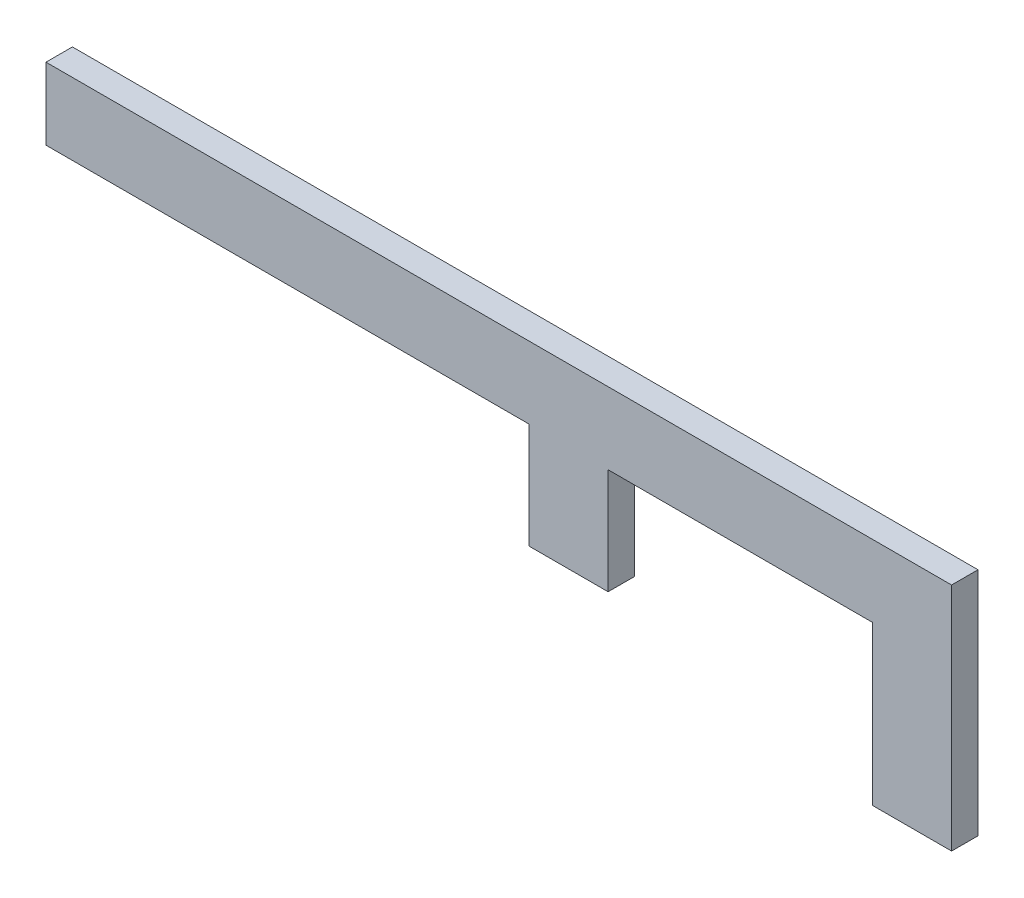
ISO-10303-21;
HEADER;
FILE_DESCRIPTION(('STEP AP214'),'2;1');
FILE_NAME('part.step','',(''),(''),'','','');
FILE_SCHEMA(('AUTOMOTIVE_DESIGN { 1 0 10303 214 1 1 1 1 }'));
ENDSEC;
DATA;
#1=APPLICATION_CONTEXT('core data for automotive mechanical design processes');
#2=APPLICATION_PROTOCOL_DEFINITION('international standard','automotive_design',2000,#1);
#3=PRODUCT_CONTEXT('',#1,'mechanical');
#4=PRODUCT('Part','Part','',(#3));
#5=PRODUCT_RELATED_PRODUCT_CATEGORY('part','',(#4));
#6=PRODUCT_DEFINITION_FORMATION('','',#4);
#7=PRODUCT_DEFINITION_CONTEXT('part definition',#1,'design');
#8=PRODUCT_DEFINITION('design','',#6,#7);
#9=PRODUCT_DEFINITION_SHAPE('','',#8);
#10=(LENGTH_UNIT() NAMED_UNIT(*) SI_UNIT(.MILLI.,.METRE.));
#11=(NAMED_UNIT(*) PLANE_ANGLE_UNIT() SI_UNIT($,.RADIAN.));
#12=(NAMED_UNIT(*) SI_UNIT($,.STERADIAN.) SOLID_ANGLE_UNIT());
#13=UNCERTAINTY_MEASURE_WITH_UNIT(LENGTH_MEASURE(1.E-05),#10,'distance_accuracy_value','');
#14=(GEOMETRIC_REPRESENTATION_CONTEXT(3) GLOBAL_UNCERTAINTY_ASSIGNED_CONTEXT((#13)) GLOBAL_UNIT_ASSIGNED_CONTEXT((#10,
#11,#12)) REPRESENTATION_CONTEXT('',''));
#15=CARTESIAN_POINT('',(0.,0.,0.));
#16=DIRECTION('',(0.,0.,1.));
#17=DIRECTION('',(1.,0.,0.));
#18=AXIS2_PLACEMENT_3D('',#15,#16,#17);
#19=CARTESIAN_POINT('',(18.4937207754592,-27.2192634151137,10.));
#20=DIRECTION('',(0.,1.,0.));
#21=DIRECTION('',(0.,0.,1.));
#22=AXIS2_PLACEMENT_3D('',#19,#20,#21);
#23=PLANE('',#22);
#24=DIRECTION('',(0.,0.,1.));
#25=VECTOR('',#24,1.);
#26=CARTESIAN_POINT('',(127.754406597199,-27.2192634151137,10.));
#27=LINE('',#26,#25);
#28=CARTESIAN_POINT('',(127.754406597199,-27.2192634151137,0.));
#29=VERTEX_POINT('',#28);
#30=CARTESIAN_POINT('',(127.754406597199,-27.2192634151135,10.));
#31=VERTEX_POINT('',#30);
#32=EDGE_CURVE('E135',#29,#31,#27,.T.);
#33=ORIENTED_EDGE('',*,*,#32,.F.);
#34=DIRECTION('',(1.,0.,0.));
#35=VECTOR('',#34,1.);
#36=CARTESIAN_POINT('',(18.4937207754592,-27.2192634151137,0.));
#37=LINE('',#36,#35);
#38=CARTESIAN_POINT('',(227.754406597199,-27.2192634151137,0.));
#39=VERTEX_POINT('',#38);
#40=EDGE_CURVE('E172',#29,#39,#37,.T.);
#41=ORIENTED_EDGE('',*,*,#40,.T.);
#42=DIRECTION('',(0.,0.,-1.));
#43=VECTOR('',#42,1.);
#44=CARTESIAN_POINT('',(227.754406597199,-27.2192634151137,10.));
#45=LINE('',#44,#43);
#46=CARTESIAN_POINT('',(227.754406597199,-27.2192634151135,10.));
#47=VERTEX_POINT('',#46);
#48=EDGE_CURVE('E136',#47,#39,#45,.T.);
#49=ORIENTED_EDGE('',*,*,#48,.F.);
#50=DIRECTION('',(1.,0.,0.));
#51=VECTOR('',#50,1.);
#52=CARTESIAN_POINT('',(-80.,-27.2192634151137,10.));
#53=LINE('',#52,#51);
#54=EDGE_CURVE('E37',#31,#47,#53,.T.);
#55=ORIENTED_EDGE('',*,*,#54,.F.);
#56=EDGE_LOOP('',(#33,#41,#49,#55));
#57=FACE_BOUND('',#56,.T.);
#58=ADVANCED_FACE('F33',(#57),#23,.F.);
#59=DIRECTION('',(0.,0.,-1.));
#60=VECTOR('',#59,1.);
#61=CARTESIAN_POINT('',(97.754406597199,-27.2192634151137,10.));
#62=LINE('',#61,#60);
#63=CARTESIAN_POINT('',(97.7544065971989,-27.2192634151135,10.));
#64=VERTEX_POINT('',#63);
#65=CARTESIAN_POINT('',(97.7544065971989,-27.2192634151137,0.));
#66=VERTEX_POINT('',#65);
#67=EDGE_CURVE('E58',#64,#66,#62,.T.);
#68=ORIENTED_EDGE('',*,*,#67,.F.);
#69=CARTESIAN_POINT('',(-85.,-27.2192634151137,10.));
#70=VERTEX_POINT('',#69);
#71=EDGE_CURVE('E161',#70,#64,#53,.T.);
#72=ORIENTED_EDGE('',*,*,#71,.F.);
#73=DIRECTION('',(0.,0.,-1.));
#74=VECTOR('',#73,1.);
#75=CARTESIAN_POINT('',(-85.,-27.2192634151137,10.));
#76=LINE('',#75,#74);
#77=CARTESIAN_POINT('',(-85.,-27.2192634151137,0.));
#78=VERTEX_POINT('',#77);
#79=EDGE_CURVE('E43',#70,#78,#76,.T.);
#80=ORIENTED_EDGE('',*,*,#79,.T.);
#81=EDGE_CURVE('E174',#78,#66,#37,.T.);
#82=ORIENTED_EDGE('',*,*,#81,.T.);
#83=EDGE_LOOP('',(#68,#72,#80,#82));
#84=FACE_BOUND('',#83,.T.);
#85=ADVANCED_FACE('F208',(#84),#23,.F.);
#86=CARTESIAN_POINT('',(-85.,-27.2192634151137,10.));
#87=DIRECTION('',(1.,0.,0.));
#88=DIRECTION('',(0.,0.,-1.));
#89=AXIS2_PLACEMENT_3D('',#86,#87,#88);
#90=PLANE('',#89);
#91=DIRECTION('',(0.,-1.,0.));
#92=VECTOR('',#91,1.);
#93=CARTESIAN_POINT('',(-85.,-27.2192634151137,0.));
#94=LINE('',#93,#92);
#95=CARTESIAN_POINT('',(-85.,0.,0.));
#96=VERTEX_POINT('',#95);
#97=EDGE_CURVE('E170',#96,#78,#94,.T.);
#98=ORIENTED_EDGE('',*,*,#97,.T.);
#99=ORIENTED_EDGE('',*,*,#79,.F.);
#100=DIRECTION('',(0.,-1.,0.));
#101=VECTOR('',#100,1.);
#102=CARTESIAN_POINT('',(-85.,-27.2192634151137,10.));
#103=LINE('',#102,#101);
#104=CARTESIAN_POINT('',(-85.,0.,10.));
#105=VERTEX_POINT('',#104);
#106=EDGE_CURVE('E192',#105,#70,#103,.T.);
#107=ORIENTED_EDGE('',*,*,#106,.F.);
#108=DIRECTION('',(0.,0.,-1.));
#109=VECTOR('',#108,1.);
#110=CARTESIAN_POINT('',(-85.,0.,10.));
#111=LINE('',#110,#109);
#112=EDGE_CURVE('E11',#105,#96,#111,.T.);
#113=ORIENTED_EDGE('',*,*,#112,.T.);
#114=EDGE_LOOP('',(#98,#99,#107,#113));
#115=FACE_BOUND('',#114,.T.);
#116=ADVANCED_FACE('F35',(#115),#90,.F.);
#117=CARTESIAN_POINT('',(257.754406597199,0.,10.));
#118=DIRECTION('',(-1.,0.,0.));
#119=DIRECTION('',(0.,0.,1.));
#120=AXIS2_PLACEMENT_3D('',#117,#118,#119);
#121=PLANE('',#120);
#122=DIRECTION('',(0.,1.,0.));
#123=VECTOR('',#122,1.);
#124=CARTESIAN_POINT('',(257.754406597199,0.,0.));
#125=LINE('',#124,#123);
#126=CARTESIAN_POINT('',(257.754406597199,-87.2192634151137,0.));
#127=VERTEX_POINT('',#126);
#128=CARTESIAN_POINT('',(257.754406597199,0.,0.));
#129=VERTEX_POINT('',#128);
#130=EDGE_CURVE('E179',#127,#129,#125,.T.);
#131=ORIENTED_EDGE('',*,*,#130,.T.);
#132=DIRECTION('',(0.,0.,-1.));
#133=VECTOR('',#132,1.);
#134=CARTESIAN_POINT('',(257.754406597199,0.,10.));
#135=LINE('',#134,#133);
#136=CARTESIAN_POINT('',(257.754406597199,0.,10.));
#137=VERTEX_POINT('',#136);
#138=EDGE_CURVE('E185',#137,#129,#135,.T.);
#139=ORIENTED_EDGE('',*,*,#138,.F.);
#140=DIRECTION('',(0.,1.,0.));
#141=VECTOR('',#140,1.);
#142=CARTESIAN_POINT('',(257.754406597199,0.,10.));
#143=LINE('',#142,#141);
#144=CARTESIAN_POINT('',(257.754406597199,-87.2192634151137,10.));
#145=VERTEX_POINT('',#144);
#146=EDGE_CURVE('E187',#145,#137,#143,.T.);
#147=ORIENTED_EDGE('',*,*,#146,.F.);
#148=DIRECTION('',(0.,0.,1.));
#149=VECTOR('',#148,1.);
#150=CARTESIAN_POINT('',(257.754406597199,-87.2192634151137,10.));
#151=LINE('',#150,#149);
#152=EDGE_CURVE('E139',#127,#145,#151,.T.);
#153=ORIENTED_EDGE('',*,*,#152,.F.);
#154=EDGE_LOOP('',(#131,#139,#147,#153));
#155=FACE_BOUND('',#154,.T.);
#156=ADVANCED_FACE('F196',(#155),#121,.F.);
#157=CARTESIAN_POINT('',(0.,0.,10.));
#158=DIRECTION('',(0.,-1.,0.));
#159=DIRECTION('',(0.,0.,-1.));
#160=AXIS2_PLACEMENT_3D('',#157,#158,#159);
#161=PLANE('',#160);
#162=DIRECTION('',(-1.,0.,0.));
#163=VECTOR('',#162,1.);
#164=CARTESIAN_POINT('',(0.,0.,0.));
#165=LINE('',#164,#163);
#166=EDGE_CURVE('E188',#129,#96,#165,.T.);
#167=ORIENTED_EDGE('',*,*,#166,.T.);
#168=ORIENTED_EDGE('',*,*,#112,.F.);
#169=DIRECTION('',(-1.,0.,0.));
#170=VECTOR('',#169,1.);
#171=CARTESIAN_POINT('',(0.,0.,10.));
#172=LINE('',#171,#170);
#173=EDGE_CURVE('E157',#137,#105,#172,.T.);
#174=ORIENTED_EDGE('',*,*,#173,.F.);
#175=ORIENTED_EDGE('',*,*,#138,.T.);
#176=EDGE_LOOP('',(#167,#168,#174,#175));
#177=FACE_BOUND('',#176,.T.);
#178=ADVANCED_FACE('F199',(#177),#161,.F.);
#179=CARTESIAN_POINT('',(0.,0.,10.));
#180=DIRECTION('',(0.,0.,-1.));
#181=DIRECTION('',(-1.,0.,0.));
#182=AXIS2_PLACEMENT_3D('',#179,#180,#181);
#183=PLANE('',#182);
#184=ORIENTED_EDGE('',*,*,#173,.T.);
#185=ORIENTED_EDGE('',*,*,#106,.T.);
#186=ORIENTED_EDGE('',*,*,#71,.T.);
#187=DIRECTION('',(0.,1.,0.));
#188=VECTOR('',#187,1.);
#189=CARTESIAN_POINT('',(97.754406597199,-67.2192634151137,10.));
#190=LINE('',#189,#188);
#191=CARTESIAN_POINT('',(97.754406597199,-67.2192634151137,10.));
#192=VERTEX_POINT('',#191);
#193=EDGE_CURVE('E120',#192,#64,#190,.T.);
#194=ORIENTED_EDGE('',*,*,#193,.F.);
#195=DIRECTION('',(-1.,0.,0.));
#196=VECTOR('',#195,1.);
#197=CARTESIAN_POINT('',(127.754406597199,-67.2192634151137,10.));
#198=LINE('',#197,#196);
#199=CARTESIAN_POINT('',(127.754406597199,-67.2192634151137,10.));
#200=VERTEX_POINT('',#199);
#201=EDGE_CURVE('E113',#200,#192,#198,.T.);
#202=ORIENTED_EDGE('',*,*,#201,.F.);
#203=DIRECTION('',(0.,1.,0.));
#204=VECTOR('',#203,1.);
#205=CARTESIAN_POINT('',(127.754406597199,-67.2192634151137,10.));
#206=LINE('',#205,#204);
#207=EDGE_CURVE('E117',#200,#31,#206,.T.);
#208=ORIENTED_EDGE('',*,*,#207,.T.);
#209=ORIENTED_EDGE('',*,*,#54,.T.);
#210=DIRECTION('',(0.,1.,0.));
#211=VECTOR('',#210,1.);
#212=CARTESIAN_POINT('',(227.754406597199,-87.2192634151137,10.));
#213=LINE('',#212,#211);
#214=CARTESIAN_POINT('',(227.754406597199,-87.2192634151137,10.));
#215=VERTEX_POINT('',#214);
#216=EDGE_CURVE('E165',#215,#47,#213,.T.);
#217=ORIENTED_EDGE('',*,*,#216,.F.);
#218=DIRECTION('',(-1.,0.,0.));
#219=VECTOR('',#218,1.);
#220=CARTESIAN_POINT('',(257.754406597199,-87.2192634151137,10.));
#221=LINE('',#220,#219);
#222=EDGE_CURVE('E147',#145,#215,#221,.T.);
#223=ORIENTED_EDGE('',*,*,#222,.F.);
#224=ORIENTED_EDGE('',*,*,#146,.T.);
#225=EDGE_LOOP('',(#184,#185,#186,#194,#202,#208,#209,#217,#223,#224));
#226=FACE_BOUND('',#225,.T.);
#227=ADVANCED_FACE('F115',(#226),#183,.F.);
#228=CARTESIAN_POINT('',(0.,0.,0.));
#229=DIRECTION('',(0.,0.,-1.));
#230=DIRECTION('',(-1.,0.,0.));
#231=AXIS2_PLACEMENT_3D('',#228,#229,#230);
#232=PLANE('',#231);
#233=ORIENTED_EDGE('',*,*,#97,.F.);
#234=ORIENTED_EDGE('',*,*,#166,.F.);
#235=ORIENTED_EDGE('',*,*,#130,.F.);
#236=DIRECTION('',(1.,0.,0.));
#237=VECTOR('',#236,1.);
#238=CARTESIAN_POINT('',(257.754406597199,-87.2192634151137,0.));
#239=LINE('',#238,#237);
#240=CARTESIAN_POINT('',(227.754406597199,-87.2192634151137,0.));
#241=VERTEX_POINT('',#240);
#242=EDGE_CURVE('E151',#241,#127,#239,.T.);
#243=ORIENTED_EDGE('',*,*,#242,.F.);
#244=DIRECTION('',(0.,1.,0.));
#245=VECTOR('',#244,1.);
#246=CARTESIAN_POINT('',(227.754406597199,-87.2192634151137,0.));
#247=LINE('',#246,#245);
#248=EDGE_CURVE('E154',#241,#39,#247,.T.);
#249=ORIENTED_EDGE('',*,*,#248,.T.);
#250=ORIENTED_EDGE('',*,*,#40,.F.);
#251=DIRECTION('',(0.,1.,0.));
#252=VECTOR('',#251,1.);
#253=CARTESIAN_POINT('',(127.754406597199,-67.2192634151137,0.));
#254=LINE('',#253,#252);
#255=CARTESIAN_POINT('',(127.754406597199,-67.2192634151137,0.));
#256=VERTEX_POINT('',#255);
#257=EDGE_CURVE('E220',#256,#29,#254,.T.);
#258=ORIENTED_EDGE('',*,*,#257,.F.);
#259=DIRECTION('',(1.,0.,0.));
#260=VECTOR('',#259,1.);
#261=CARTESIAN_POINT('',(127.754406597199,-67.2192634151137,0.));
#262=LINE('',#261,#260);
#263=CARTESIAN_POINT('',(97.7544065971989,-67.2192634151137,0.));
#264=VERTEX_POINT('',#263);
#265=EDGE_CURVE('E129',#264,#256,#262,.T.);
#266=ORIENTED_EDGE('',*,*,#265,.F.);
#267=DIRECTION('',(0.,1.,0.));
#268=VECTOR('',#267,1.);
#269=CARTESIAN_POINT('',(97.7544065971989,-67.2192634151137,0.));
#270=LINE('',#269,#268);
#271=EDGE_CURVE('E141',#264,#66,#270,.T.);
#272=ORIENTED_EDGE('',*,*,#271,.T.);
#273=ORIENTED_EDGE('',*,*,#81,.F.);
#274=EDGE_LOOP('',(#233,#234,#235,#243,#249,#250,#258,#266,#272,#273));
#275=FACE_BOUND('',#274,.T.);
#276=ADVANCED_FACE('F202',(#275),#232,.T.);
#277=CARTESIAN_POINT('',(227.754406597199,-87.2192634151137,10.));
#278=DIRECTION('',(1.,0.,0.));
#279=DIRECTION('',(0.,0.,-1.));
#280=AXIS2_PLACEMENT_3D('',#277,#278,#279);
#281=PLANE('',#280);
#282=ORIENTED_EDGE('',*,*,#48,.T.);
#283=ORIENTED_EDGE('',*,*,#248,.F.);
#284=DIRECTION('',(0.,0.,-1.));
#285=VECTOR('',#284,1.);
#286=CARTESIAN_POINT('',(227.754406597199,-87.2192634151137,10.));
#287=LINE('',#286,#285);
#288=EDGE_CURVE('E149',#215,#241,#287,.T.);
#289=ORIENTED_EDGE('',*,*,#288,.F.);
#290=ORIENTED_EDGE('',*,*,#216,.T.);
#291=EDGE_LOOP('',(#282,#283,#289,#290));
#292=FACE_BOUND('',#291,.T.);
#293=ADVANCED_FACE('F218',(#292),#281,.F.);
#294=CARTESIAN_POINT('',(0.,-87.2192634151137,0.));
#295=DIRECTION('',(0.,1.,0.));
#296=DIRECTION('',(0.,0.,1.));
#297=AXIS2_PLACEMENT_3D('',#294,#295,#296);
#298=PLANE('',#297);
#299=ORIENTED_EDGE('',*,*,#152,.T.);
#300=ORIENTED_EDGE('',*,*,#222,.T.);
#301=ORIENTED_EDGE('',*,*,#288,.T.);
#302=ORIENTED_EDGE('',*,*,#242,.T.);
#303=EDGE_LOOP('',(#299,#300,#301,#302));
#304=FACE_BOUND('',#303,.T.);
#305=ADVANCED_FACE('F215',(#304),#298,.F.);
#306=CARTESIAN_POINT('',(127.754406597199,-67.2192634151137,10.));
#307=DIRECTION('',(-1.,0.,0.));
#308=DIRECTION('',(0.,0.,1.));
#309=AXIS2_PLACEMENT_3D('',#306,#307,#308);
#310=PLANE('',#309);
#311=ORIENTED_EDGE('',*,*,#32,.T.);
#312=ORIENTED_EDGE('',*,*,#207,.F.);
#313=DIRECTION('',(0.,0.,1.));
#314=VECTOR('',#313,1.);
#315=CARTESIAN_POINT('',(127.754406597199,-67.2192634151137,10.));
#316=LINE('',#315,#314);
#317=EDGE_CURVE('E124',#256,#200,#316,.T.);
#318=ORIENTED_EDGE('',*,*,#317,.F.);
#319=ORIENTED_EDGE('',*,*,#257,.T.);
#320=EDGE_LOOP('',(#311,#312,#318,#319));
#321=FACE_BOUND('',#320,.T.);
#322=ADVANCED_FACE('F134',(#321),#310,.F.);
#323=CARTESIAN_POINT('',(97.754406597199,-67.2192634151137,10.));
#324=DIRECTION('',(1.,0.,0.));
#325=DIRECTION('',(0.,0.,-1.));
#326=AXIS2_PLACEMENT_3D('',#323,#324,#325);
#327=PLANE('',#326);
#328=ORIENTED_EDGE('',*,*,#67,.T.);
#329=ORIENTED_EDGE('',*,*,#271,.F.);
#330=DIRECTION('',(0.,0.,-1.));
#331=VECTOR('',#330,1.);
#332=CARTESIAN_POINT('',(97.754406597199,-67.2192634151137,10.));
#333=LINE('',#332,#331);
#334=EDGE_CURVE('E123',#192,#264,#333,.T.);
#335=ORIENTED_EDGE('',*,*,#334,.F.);
#336=ORIENTED_EDGE('',*,*,#193,.T.);
#337=EDGE_LOOP('',(#328,#329,#335,#336));
#338=FACE_BOUND('',#337,.T.);
#339=ADVANCED_FACE('F227',(#338),#327,.F.);
#340=CARTESIAN_POINT('',(0.,-67.2192634151137,0.));
#341=DIRECTION('',(0.,1.,0.));
#342=DIRECTION('',(0.,0.,1.));
#343=AXIS2_PLACEMENT_3D('',#340,#341,#342);
#344=PLANE('',#343);
#345=ORIENTED_EDGE('',*,*,#317,.T.);
#346=ORIENTED_EDGE('',*,*,#201,.T.);
#347=ORIENTED_EDGE('',*,*,#334,.T.);
#348=ORIENTED_EDGE('',*,*,#265,.T.);
#349=EDGE_LOOP('',(#345,#346,#347,#348));
#350=FACE_BOUND('',#349,.T.);
#351=ADVANCED_FACE('F127',(#350),#344,.F.);
#352=CLOSED_SHELL('',(#58,#85,#116,#156,#178,#227,#276,#293,#305,#322,#339,#351));
#353=MANIFOLD_SOLID_BREP('B2',#352);
#354=ADVANCED_BREP_SHAPE_REPRESENTATION('',(#18,#353),#14);
#355=SHAPE_DEFINITION_REPRESENTATION(#9,#354);
ENDSEC;
END-ISO-10303-21;
